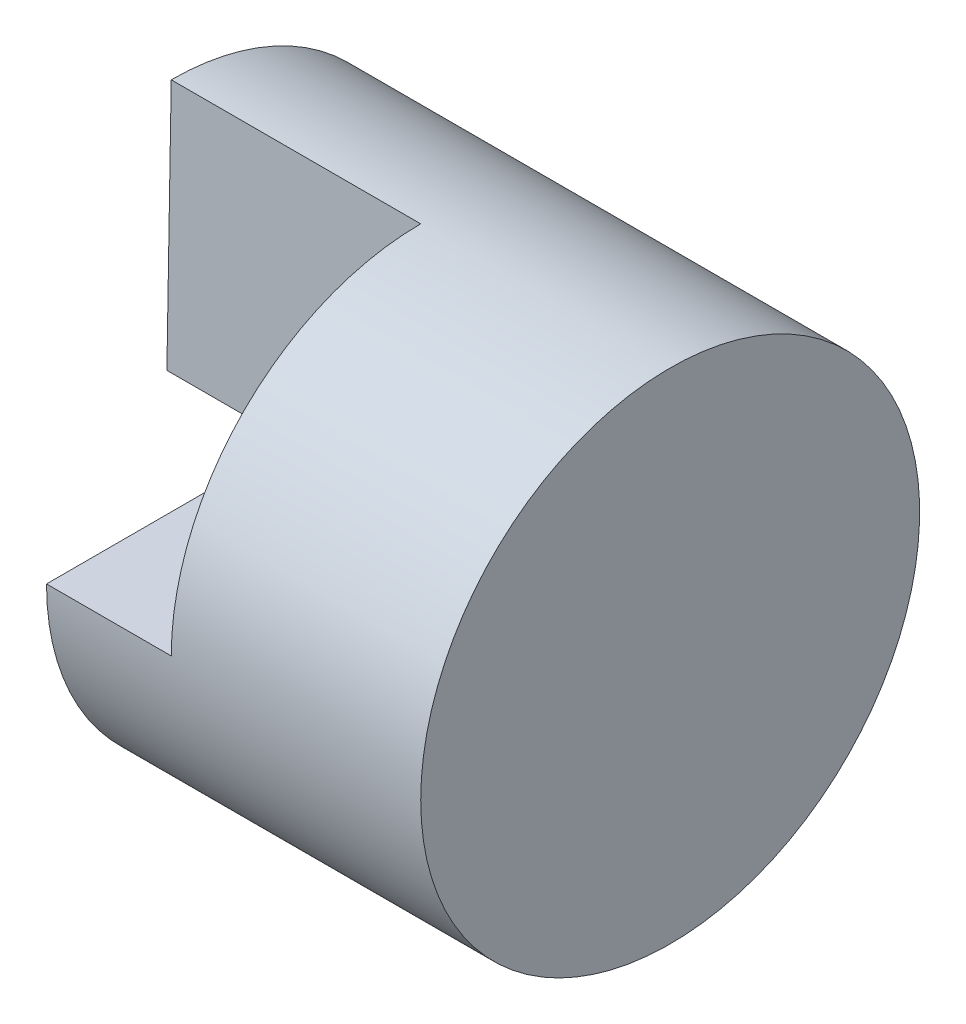
ISO-10303-21;
HEADER;
FILE_DESCRIPTION(('STEP AP214'),'2;1');
FILE_NAME('part.step','',(''),(''),'','','');
FILE_SCHEMA(('AUTOMOTIVE_DESIGN { 1 0 10303 214 1 1 1 1 }'));
ENDSEC;
DATA;
#1=APPLICATION_CONTEXT('core data for automotive mechanical design processes');
#2=APPLICATION_PROTOCOL_DEFINITION('international standard','automotive_design',2000,#1);
#3=PRODUCT_CONTEXT('',#1,'mechanical');
#4=PRODUCT('Part','Part','',(#3));
#5=PRODUCT_RELATED_PRODUCT_CATEGORY('part','',(#4));
#6=PRODUCT_DEFINITION_FORMATION('','',#4);
#7=PRODUCT_DEFINITION_CONTEXT('part definition',#1,'design');
#8=PRODUCT_DEFINITION('design','',#6,#7);
#9=PRODUCT_DEFINITION_SHAPE('','',#8);
#10=(LENGTH_UNIT() NAMED_UNIT(*) SI_UNIT(.MILLI.,.METRE.));
#11=(NAMED_UNIT(*) PLANE_ANGLE_UNIT() SI_UNIT($,.RADIAN.));
#12=(NAMED_UNIT(*) SI_UNIT($,.STERADIAN.) SOLID_ANGLE_UNIT());
#13=UNCERTAINTY_MEASURE_WITH_UNIT(LENGTH_MEASURE(1.E-05),#10,'distance_accuracy_value','');
#14=(GEOMETRIC_REPRESENTATION_CONTEXT(3) GLOBAL_UNCERTAINTY_ASSIGNED_CONTEXT((#13)) GLOBAL_UNIT_ASSIGNED_CONTEXT((#10,
#11,#12)) REPRESENTATION_CONTEXT('',''));
#15=CARTESIAN_POINT('',(0.,0.,0.));
#16=DIRECTION('',(0.,0.,1.));
#17=DIRECTION('',(1.,0.,0.));
#18=AXIS2_PLACEMENT_3D('',#15,#16,#17);
#19=CARTESIAN_POINT('',(0.,0.,0.));
#20=DIRECTION('',(-1.,0.,0.));
#21=DIRECTION('',(0.,0.,1.));
#22=AXIS2_PLACEMENT_3D('',#19,#20,#21);
#23=CYLINDRICAL_SURFACE('',#22,2.);
#24=DIRECTION('',(-1.,0.,0.));
#25=VECTOR('',#24,1.);
#26=CARTESIAN_POINT('',(0.,0.,-2.));
#27=LINE('',#26,#25);
#28=CARTESIAN_POINT('',(0.,0.,-2.));
#29=VERTEX_POINT('',#28);
#30=CARTESIAN_POINT('',(1.,0.,-2.));
#31=VERTEX_POINT('',#30);
#32=EDGE_CURVE('E82',#29,#31,#27,.F.);
#33=ORIENTED_EDGE('',*,*,#32,.F.);
#34=CARTESIAN_POINT('',(0.,0.,0.));
#35=DIRECTION('',(-1.,0.,0.));
#36=DIRECTION('',(0.,0.,1.));
#37=AXIS2_PLACEMENT_3D('',#34,#35,#36);
#38=CIRCLE('',#37,2.);
#39=CARTESIAN_POINT('',(0.,2.,0.));
#40=VERTEX_POINT('',#39);
#41=EDGE_CURVE('E40',#40,#29,#38,.T.);
#42=ORIENTED_EDGE('',*,*,#41,.F.);
#43=DIRECTION('',(1.,0.,0.));
#44=VECTOR('',#43,1.);
#45=CARTESIAN_POINT('',(0.5,2.,0.));
#46=LINE('',#45,#44);
#47=CARTESIAN_POINT('',(2.,2.,0.));
#48=VERTEX_POINT('',#47);
#49=EDGE_CURVE('E97',#40,#48,#46,.T.);
#50=ORIENTED_EDGE('',*,*,#49,.T.);
#51=CARTESIAN_POINT('',(2.,0.,0.));
#52=DIRECTION('',(1.,0.,0.));
#53=DIRECTION('',(0.,0.,-1.));
#54=AXIS2_PLACEMENT_3D('',#51,#52,#53);
#55=CIRCLE('',#54,2.);
#56=CARTESIAN_POINT('',(2.,0.,2.));
#57=VERTEX_POINT('',#56);
#58=EDGE_CURVE('E11',#57,#48,#55,.F.);
#59=ORIENTED_EDGE('',*,*,#58,.F.);
#60=DIRECTION('',(-1.,0.,0.));
#61=VECTOR('',#60,1.);
#62=CARTESIAN_POINT('',(0.,0.,2.));
#63=LINE('',#62,#61);
#64=CARTESIAN_POINT('',(1.,0.,2.));
#65=VERTEX_POINT('',#64);
#66=EDGE_CURVE('E54',#65,#57,#63,.F.);
#67=ORIENTED_EDGE('',*,*,#66,.F.);
#68=CARTESIAN_POINT('',(1.,0.,0.));
#69=DIRECTION('',(1.,0.,0.));
#70=DIRECTION('',(0.,0.,-1.));
#71=AXIS2_PLACEMENT_3D('',#68,#69,#70);
#72=CIRCLE('',#71,2.);
#73=EDGE_CURVE('E76',#31,#65,#72,.F.);
#74=ORIENTED_EDGE('',*,*,#73,.F.);
#75=EDGE_LOOP('',(#33,#42,#50,#59,#67,#74));
#76=FACE_BOUND('',#75,.T.);
#77=CARTESIAN_POINT('',(4.,0.,0.));
#78=DIRECTION('',(-1.,0.,0.));
#79=DIRECTION('',(0.,0.,1.));
#80=AXIS2_PLACEMENT_3D('',#77,#78,#79);
#81=CIRCLE('',#80,2.);
#82=CARTESIAN_POINT('',(4.,0.,2.));
#83=VERTEX_POINT('',#82);
#84=EDGE_CURVE('E92',#83,#83,#81,.T.);
#85=ORIENTED_EDGE('',*,*,#84,.T.);
#86=EDGE_LOOP('',(#85));
#87=FACE_BOUND('',#86,.T.);
#88=ADVANCED_FACE('F33',(#76,#87),#23,.T.);
#89=CARTESIAN_POINT('',(4.,0.,0.));
#90=DIRECTION('',(-1.,0.,0.));
#91=DIRECTION('',(0.,0.,1.));
#92=AXIS2_PLACEMENT_3D('',#89,#90,#91);
#93=PLANE('',#92);
#94=ORIENTED_EDGE('',*,*,#84,.F.);
#95=EDGE_LOOP('',(#94));
#96=FACE_BOUND('',#95,.T.);
#97=ADVANCED_FACE('F133',(#96),#93,.F.);
#98=CARTESIAN_POINT('',(0.,-2.,0.));
#99=DIRECTION('',(1.,0.,0.));
#100=DIRECTION('',(0.,0.,-1.));
#101=AXIS2_PLACEMENT_3D('',#98,#99,#100);
#102=PLANE('',#101);
#103=ORIENTED_EDGE('',*,*,#41,.T.);
#104=DIRECTION('',(0.,0.,-1.));
#105=VECTOR('',#104,1.);
#106=CARTESIAN_POINT('',(0.,0.,2.));
#107=LINE('',#106,#105);
#108=CARTESIAN_POINT('',(0.,0.,0.034977088325542));
#109=VERTEX_POINT('',#108);
#110=EDGE_CURVE('E105',#109,#29,#107,.T.);
#111=ORIENTED_EDGE('',*,*,#110,.F.);
#112=DIRECTION('',(0.,-0.99984711048149,0.017485870347671));
#113=VECTOR('',#112,1.);
#114=CARTESIAN_POINT('',(0.,0.,0.0349770883255419));
#115=LINE('',#114,#113);
#116=EDGE_CURVE('E81',#40,#109,#115,.T.);
#117=ORIENTED_EDGE('',*,*,#116,.F.);
#118=EDGE_LOOP('',(#103,#111,#117));
#119=FACE_BOUND('',#118,.T.);
#120=ADVANCED_FACE('F104',(#119),#102,.F.);
#121=CARTESIAN_POINT('',(0.,0.,-11.));
#122=DIRECTION('',(0.,-1.,0.));
#123=DIRECTION('',(1.,0.,0.));
#124=AXIS2_PLACEMENT_3D('',#121,#122,#123);
#125=PLANE('',#124);
#126=DIRECTION('',(1.,0.,0.));
#127=VECTOR('',#126,1.);
#128=CARTESIAN_POINT('',(0.,0.,0.0349770883255419));
#129=LINE('',#128,#127);
#130=CARTESIAN_POINT('',(1.,0.,0.0349770883255419));
#131=VERTEX_POINT('',#130);
#132=CARTESIAN_POINT('',(2.,0.,0.0349770883255419));
#133=VERTEX_POINT('',#132);
#134=EDGE_CURVE('E86',#131,#133,#129,.T.);
#135=ORIENTED_EDGE('',*,*,#134,.F.);
#136=DIRECTION('',(0.,0.,-1.));
#137=VECTOR('',#136,1.);
#138=CARTESIAN_POINT('',(1.,0.,2.));
#139=LINE('',#138,#137);
#140=EDGE_CURVE('E47',#65,#131,#139,.T.);
#141=ORIENTED_EDGE('',*,*,#140,.F.);
#142=ORIENTED_EDGE('',*,*,#66,.T.);
#143=DIRECTION('',(0.,0.,-1.));
#144=VECTOR('',#143,1.);
#145=CARTESIAN_POINT('',(2.,0.,10.));
#146=LINE('',#145,#144);
#147=EDGE_CURVE('E93',#57,#133,#146,.T.);
#148=ORIENTED_EDGE('',*,*,#147,.T.);
#149=EDGE_LOOP('',(#135,#141,#142,#148));
#150=FACE_BOUND('',#149,.T.);
#151=ADVANCED_FACE('F85',(#150),#125,.F.);
#152=CARTESIAN_POINT('',(2.,0.,10.));
#153=DIRECTION('',(1.,0.,0.));
#154=DIRECTION('',(0.,0.,-1.));
#155=AXIS2_PLACEMENT_3D('',#152,#153,#154);
#156=PLANE('',#155);
#157=ORIENTED_EDGE('',*,*,#58,.T.);
#158=DIRECTION('',(0.,-0.99984711048149,0.017485870347671));
#159=VECTOR('',#158,1.);
#160=CARTESIAN_POINT('',(2.,-0.174220458090097,0.0380239505009088));
#161=LINE('',#160,#159);
#162=EDGE_CURVE('E111',#48,#133,#161,.T.);
#163=ORIENTED_EDGE('',*,*,#162,.T.);
#164=ORIENTED_EDGE('',*,*,#147,.F.);
#165=EDGE_LOOP('',(#157,#163,#164));
#166=FACE_BOUND('',#165,.T.);
#167=ADVANCED_FACE('F121',(#166),#156,.F.);
#168=CARTESIAN_POINT('',(0.,0.,0.0349770883255419));
#169=DIRECTION('',(0.,0.017485870347671,0.99984711048149));
#170=DIRECTION('',(0.,-0.99984711048149,0.017485870347671));
#171=AXIS2_PLACEMENT_3D('',#168,#169,#170);
#172=PLANE('',#171);
#173=ORIENTED_EDGE('',*,*,#162,.F.);
#174=ORIENTED_EDGE('',*,*,#49,.F.);
#175=ORIENTED_EDGE('',*,*,#116,.T.);
#176=EDGE_CURVE('E112',#109,#131,#129,.T.);
#177=ORIENTED_EDGE('',*,*,#176,.T.);
#178=ORIENTED_EDGE('',*,*,#134,.T.);
#179=EDGE_LOOP('',(#173,#174,#175,#177,#178));
#180=FACE_BOUND('',#179,.T.);
#181=ADVANCED_FACE('F109',(#180),#172,.T.);
#182=CARTESIAN_POINT('',(1.,0.,2.));
#183=DIRECTION('',(0.,1.,0.));
#184=DIRECTION('',(0.,0.,1.));
#185=AXIS2_PLACEMENT_3D('',#182,#183,#184);
#186=PLANE('',#185);
#187=ORIENTED_EDGE('',*,*,#32,.T.);
#188=EDGE_CURVE('E78',#131,#31,#139,.T.);
#189=ORIENTED_EDGE('',*,*,#188,.F.);
#190=ORIENTED_EDGE('',*,*,#176,.F.);
#191=ORIENTED_EDGE('',*,*,#110,.T.);
#192=EDGE_LOOP('',(#187,#189,#190,#191));
#193=FACE_BOUND('',#192,.T.);
#194=ADVANCED_FACE('F119',(#193),#186,.F.);
#195=CARTESIAN_POINT('',(1.,0.,0.));
#196=DIRECTION('',(1.,0.,0.));
#197=DIRECTION('',(0.,0.,-1.));
#198=AXIS2_PLACEMENT_3D('',#195,#196,#197);
#199=PLANE('',#198);
#200=ORIENTED_EDGE('',*,*,#73,.T.);
#201=ORIENTED_EDGE('',*,*,#140,.T.);
#202=ORIENTED_EDGE('',*,*,#188,.T.);
#203=EDGE_LOOP('',(#200,#201,#202));
#204=FACE_BOUND('',#203,.T.);
#205=ADVANCED_FACE('F77',(#204),#199,.F.);
#206=CLOSED_SHELL('',(#88,#97,#120,#151,#167,#181,#194,#205));
#207=MANIFOLD_SOLID_BREP('B2',#206);
#208=ADVANCED_BREP_SHAPE_REPRESENTATION('',(#18,#207),#14);
#209=SHAPE_DEFINITION_REPRESENTATION(#9,#208);
ENDSEC;
END-ISO-10303-21;
